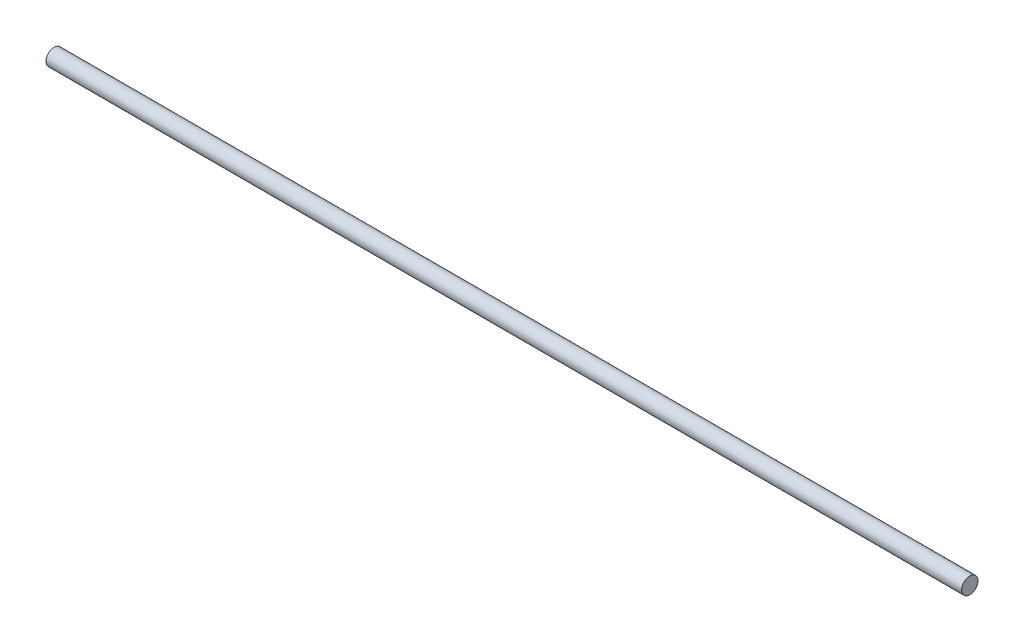
ISO-10303-21;
HEADER;
FILE_DESCRIPTION(('STEP AP214'),'2;1');
FILE_NAME('part.step','',(''),(''),'','','');
FILE_SCHEMA(('AUTOMOTIVE_DESIGN { 1 0 10303 214 1 1 1 1 }'));
ENDSEC;
DATA;
#1=APPLICATION_CONTEXT('core data for automotive mechanical design processes');
#2=APPLICATION_PROTOCOL_DEFINITION('international standard','automotive_design',2000,#1);
#3=PRODUCT_CONTEXT('',#1,'mechanical');
#4=PRODUCT('Part','Part','',(#3));
#5=PRODUCT_RELATED_PRODUCT_CATEGORY('part','',(#4));
#6=PRODUCT_DEFINITION_FORMATION('','',#4);
#7=PRODUCT_DEFINITION_CONTEXT('part definition',#1,'design');
#8=PRODUCT_DEFINITION('design','',#6,#7);
#9=PRODUCT_DEFINITION_SHAPE('','',#8);
#10=(LENGTH_UNIT() NAMED_UNIT(*) SI_UNIT(.MILLI.,.METRE.));
#11=(NAMED_UNIT(*) PLANE_ANGLE_UNIT() SI_UNIT($,.RADIAN.));
#12=(NAMED_UNIT(*) SI_UNIT($,.STERADIAN.) SOLID_ANGLE_UNIT());
#13=UNCERTAINTY_MEASURE_WITH_UNIT(LENGTH_MEASURE(1.E-05),#10,'distance_accuracy_value','');
#14=(GEOMETRIC_REPRESENTATION_CONTEXT(3) GLOBAL_UNCERTAINTY_ASSIGNED_CONTEXT((#13)) GLOBAL_UNIT_ASSIGNED_CONTEXT((#10,
#11,#12)) REPRESENTATION_CONTEXT('',''));
#15=CARTESIAN_POINT('',(0.,0.,0.));
#16=DIRECTION('',(0.,0.,1.));
#17=DIRECTION('',(1.,0.,0.));
#18=AXIS2_PLACEMENT_3D('',#15,#16,#17);
#19=CARTESIAN_POINT('',(280.,0.,0.));
#20=DIRECTION('',(-1.,0.,0.));
#21=DIRECTION('',(0.,0.,1.));
#22=AXIS2_PLACEMENT_3D('',#19,#20,#21);
#23=CYLINDRICAL_SURFACE('',#22,2.5);
#24=CARTESIAN_POINT('',(280.,0.,0.));
#25=DIRECTION('',(1.,0.,0.));
#26=DIRECTION('',(0.,0.,-1.));
#27=AXIS2_PLACEMENT_3D('',#24,#25,#26);
#28=CIRCLE('',#27,2.5);
#29=CARTESIAN_POINT('',(280.,0.,-2.5));
#30=VERTEX_POINT('',#29);
#31=EDGE_CURVE('E10',#30,#30,#28,.T.);
#32=ORIENTED_EDGE('',*,*,#31,.F.);
#33=EDGE_LOOP('',(#32));
#34=FACE_BOUND('',#33,.T.);
#35=CARTESIAN_POINT('',(0.,0.,0.));
#36=DIRECTION('',(1.,0.,0.));
#37=DIRECTION('',(0.,0.,-1.));
#38=AXIS2_PLACEMENT_3D('',#35,#36,#37);
#39=CIRCLE('',#38,2.5);
#40=CARTESIAN_POINT('',(0.,0.,-2.5));
#41=VERTEX_POINT('',#40);
#42=EDGE_CURVE('E34',#41,#41,#39,.T.);
#43=ORIENTED_EDGE('',*,*,#42,.T.);
#44=EDGE_LOOP('',(#43));
#45=FACE_BOUND('',#44,.T.);
#46=ADVANCED_FACE('F31',(#34,#45),#23,.T.);
#47=CARTESIAN_POINT('',(280.,0.,0.));
#48=DIRECTION('',(1.,0.,0.));
#49=DIRECTION('',(0.,0.,-1.));
#50=AXIS2_PLACEMENT_3D('',#47,#48,#49);
#51=PLANE('',#50);
#52=ORIENTED_EDGE('',*,*,#31,.T.);
#53=EDGE_LOOP('',(#52));
#54=FACE_BOUND('',#53,.T.);
#55=ADVANCED_FACE('F46',(#54),#51,.T.);
#56=CARTESIAN_POINT('',(0.,0.,0.));
#57=DIRECTION('',(1.,0.,0.));
#58=DIRECTION('',(0.,0.,-1.));
#59=AXIS2_PLACEMENT_3D('',#56,#57,#58);
#60=PLANE('',#59);
#61=ORIENTED_EDGE('',*,*,#42,.F.);
#62=EDGE_LOOP('',(#61));
#63=FACE_BOUND('',#62,.T.);
#64=ADVANCED_FACE('F44',(#63),#60,.F.);
#65=CLOSED_SHELL('',(#46,#55,#64));
#66=MANIFOLD_SOLID_BREP('B2',#65);
#67=ADVANCED_BREP_SHAPE_REPRESENTATION('',(#18,#66),#14);
#68=SHAPE_DEFINITION_REPRESENTATION(#9,#67);
ENDSEC;
END-ISO-10303-21;
